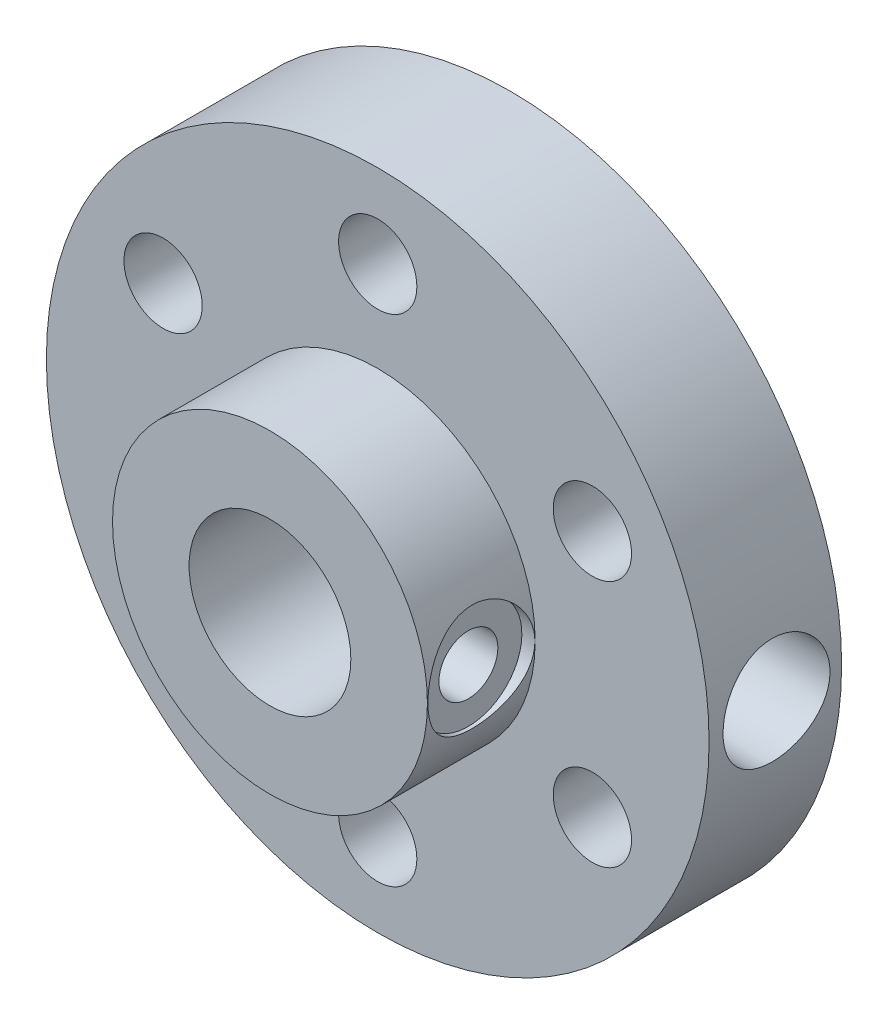
ISO-10303-21;
HEADER;
FILE_DESCRIPTION(('STEP AP214'),'2;1');
FILE_NAME('part.step','',(''),(''),'','','');
FILE_SCHEMA(('AUTOMOTIVE_DESIGN { 1 0 10303 214 1 1 1 1 }'));
ENDSEC;
DATA;
#1=APPLICATION_CONTEXT('core data for automotive mechanical design processes');
#2=APPLICATION_PROTOCOL_DEFINITION('international standard','automotive_design',2000,#1);
#3=PRODUCT_CONTEXT('',#1,'mechanical');
#4=PRODUCT('Part','Part','',(#3));
#5=PRODUCT_RELATED_PRODUCT_CATEGORY('part','',(#4));
#6=PRODUCT_DEFINITION_FORMATION('','',#4);
#7=PRODUCT_DEFINITION_CONTEXT('part definition',#1,'design');
#8=PRODUCT_DEFINITION('design','',#6,#7);
#9=PRODUCT_DEFINITION_SHAPE('','',#8);
#10=(LENGTH_UNIT() NAMED_UNIT(*) SI_UNIT(.MILLI.,.METRE.));
#11=(NAMED_UNIT(*) PLANE_ANGLE_UNIT() SI_UNIT($,.RADIAN.));
#12=(NAMED_UNIT(*) SI_UNIT($,.STERADIAN.) SOLID_ANGLE_UNIT());
#13=UNCERTAINTY_MEASURE_WITH_UNIT(LENGTH_MEASURE(1.E-05),#10,'distance_accuracy_value','');
#14=(GEOMETRIC_REPRESENTATION_CONTEXT(3) GLOBAL_UNCERTAINTY_ASSIGNED_CONTEXT((#13)) GLOBAL_UNIT_ASSIGNED_CONTEXT((#10,
#11,#12)) REPRESENTATION_CONTEXT('',''));
#15=CARTESIAN_POINT('',(0.,0.,0.));
#16=DIRECTION('',(0.,0.,1.));
#17=DIRECTION('',(1.,0.,0.));
#18=AXIS2_PLACEMENT_3D('',#15,#16,#17);
#19=CARTESIAN_POINT('',(0.,0.,5.08));
#20=DIRECTION('',(0.,0.,1.));
#21=DIRECTION('',(1.,0.,0.));
#22=AXIS2_PLACEMENT_3D('',#19,#20,#21);
#23=PLANE('',#22);
#24=CARTESIAN_POINT('',(0.,9.5,5.08));
#25=DIRECTION('',(0.,0.,1.));
#26=DIRECTION('',(1.,0.,0.));
#27=AXIS2_PLACEMENT_3D('',#24,#25,#26);
#28=CIRCLE('',#27,1.5);
#29=CARTESIAN_POINT('',(1.5,9.5,5.08));
#30=VERTEX_POINT('',#29);
#31=EDGE_CURVE('E225',#30,#30,#28,.T.);
#32=ORIENTED_EDGE('',*,*,#31,.F.);
#33=EDGE_LOOP('',(#32));
#34=FACE_BOUND('',#33,.T.);
#35=CARTESIAN_POINT('',(-8.22724133595197,4.74999999999964,5.08));
#36=DIRECTION('',(0.,0.,1.));
#37=DIRECTION('',(1.,0.,0.));
#38=AXIS2_PLACEMENT_3D('',#35,#36,#37);
#39=CIRCLE('',#38,1.50000000000041);
#40=CARTESIAN_POINT('',(-6.72724133595156,4.74999999999964,5.08));
#41=VERTEX_POINT('',#40);
#42=EDGE_CURVE('E259',#41,#41,#39,.T.);
#43=ORIENTED_EDGE('',*,*,#42,.F.);
#44=EDGE_LOOP('',(#43));
#45=FACE_BOUND('',#44,.T.);
#46=CARTESIAN_POINT('',(-8.22724133595156,-4.75000000000035,5.08));
#47=DIRECTION('',(0.,0.,1.));
#48=DIRECTION('',(1.,0.,0.));
#49=AXIS2_PLACEMENT_3D('',#46,#47,#48);
#50=CIRCLE('',#49,1.50000000000077);
#51=CARTESIAN_POINT('',(-6.72724133595079,-4.75000000000035,5.08));
#52=VERTEX_POINT('',#51);
#53=EDGE_CURVE('E262',#52,#52,#50,.T.);
#54=ORIENTED_EDGE('',*,*,#53,.F.);
#55=EDGE_LOOP('',(#54));
#56=FACE_BOUND('',#55,.T.);
#57=CARTESIAN_POINT('',(8.08855304307324E-13,-9.5,5.08));
#58=DIRECTION('',(0.,0.,1.));
#59=DIRECTION('',(1.,0.,0.));
#60=AXIS2_PLACEMENT_3D('',#57,#58,#59);
#61=CIRCLE('',#60,1.50000000000084);
#62=CARTESIAN_POINT('',(1.50000000000165,-9.5,5.08));
#63=VERTEX_POINT('',#62);
#64=EDGE_CURVE('E267',#63,#63,#61,.T.);
#65=ORIENTED_EDGE('',*,*,#64,.F.);
#66=EDGE_LOOP('',(#65));
#67=FACE_BOUND('',#66,.T.);
#68=CARTESIAN_POINT('',(8.22724133595277,-4.74999999999965,5.08));
#69=DIRECTION('',(0.,0.,1.));
#70=DIRECTION('',(1.,0.,0.));
#71=AXIS2_PLACEMENT_3D('',#68,#69,#70);
#72=CIRCLE('',#71,1.50000000000052);
#73=CARTESIAN_POINT('',(9.7272413359533,-4.74999999999965,5.08));
#74=VERTEX_POINT('',#73);
#75=EDGE_CURVE('E256',#74,#74,#72,.T.);
#76=ORIENTED_EDGE('',*,*,#75,.F.);
#77=EDGE_LOOP('',(#76));
#78=FACE_BOUND('',#77,.T.);
#79=CARTESIAN_POINT('',(8.22724133595237,4.75000000000035,5.08));
#80=DIRECTION('',(0.,0.,1.));
#81=DIRECTION('',(1.,0.,0.));
#82=AXIS2_PLACEMENT_3D('',#79,#80,#81);
#83=CIRCLE('',#82,1.50000000000011);
#84=CARTESIAN_POINT('',(9.72724133595248,4.75000000000035,5.08));
#85=VERTEX_POINT('',#84);
#86=EDGE_CURVE('E252',#85,#85,#83,.T.);
#87=ORIENTED_EDGE('',*,*,#86,.F.);
#88=EDGE_LOOP('',(#87));
#89=FACE_BOUND('',#88,.T.);
#90=CARTESIAN_POINT('',(0.,0.,5.08));
#91=DIRECTION('',(0.,0.,1.));
#92=DIRECTION('',(1.,0.,0.));
#93=AXIS2_PLACEMENT_3D('',#90,#91,#92);
#94=CIRCLE('',#93,12.7);
#95=CARTESIAN_POINT('',(12.7,0.,5.08));
#96=VERTEX_POINT('',#95);
#97=EDGE_CURVE('E57',#96,#96,#94,.T.);
#98=ORIENTED_EDGE('',*,*,#97,.T.);
#99=EDGE_LOOP('',(#98));
#100=FACE_BOUND('',#99,.T.);
#101=CARTESIAN_POINT('',(0.,0.,5.08));
#102=DIRECTION('',(0.,0.,1.));
#103=DIRECTION('',(1.,0.,0.));
#104=AXIS2_PLACEMENT_3D('',#101,#102,#103);
#105=CIRCLE('',#104,6.035);
#106=CARTESIAN_POINT('',(6.035,0.,5.08));
#107=VERTEX_POINT('',#106);
#108=EDGE_CURVE('E111',#107,#107,#105,.T.);
#109=ORIENTED_EDGE('',*,*,#108,.F.);
#110=EDGE_LOOP('',(#109));
#111=FACE_BOUND('',#110,.T.);
#112=ADVANCED_FACE('F41',(#34,#45,#56,#67,#78,#89,#100,#111),#23,.T.);
#113=CARTESIAN_POINT('',(0.,0.,5.08));
#114=DIRECTION('',(0.,0.,-1.));
#115=DIRECTION('',(-1.,0.,0.));
#116=AXIS2_PLACEMENT_3D('',#113,#114,#115);
#117=CYLINDRICAL_SURFACE('',#116,12.7);
#118=CARTESIAN_POINT('',(12.5334552299037,2.05,2.49468086127914));
#119=CARTESIAN_POINT('',(12.5334572486081,2.04999536101024,2.38033915071411));
#120=CARTESIAN_POINT('',(12.5350368739811,2.04040125716624,2.26593371494406));
#121=CARTESIAN_POINT('',(12.5411794272438,2.00229289242093,2.04032915086702));
#122=CARTESIAN_POINT('',(12.5457451579925,1.97376085536454,1.92913313752065));
#123=CARTESIAN_POINT('',(12.5573296356305,1.89865904966167,1.71324525419515));
#124=CARTESIAN_POINT('',(12.5643463866815,1.85210395366131,1.60854817365192));
#125=CARTESIAN_POINT('',(12.5800399323086,1.74231347431709,1.40846384542003));
#126=CARTESIAN_POINT('',(12.5887165264896,1.67908010421647,1.31307547597461));
#127=CARTESIAN_POINT('',(12.606841849714,1.53710369338824,1.13342119781227));
#128=CARTESIAN_POINT('',(12.6162963769453,1.45823657318114,1.04925391798866));
#129=CARTESIAN_POINT('',(12.6348606942541,1.28749949790615,0.895287049905271));
#130=CARTESIAN_POINT('',(12.6439704643653,1.19562879120595,0.82548829274655));
#131=CARTESIAN_POINT('',(12.6608799861256,1.00085562917657,0.701871612127254));
#132=CARTESIAN_POINT('',(12.6686721324809,0.897894393969266,0.648145174440912));
#133=CARTESIAN_POINT('',(12.682004015988,0.684261988945243,0.55878595651827));
#134=CARTESIAN_POINT('',(12.6875438906108,0.573591290171308,0.523152071940474));
#135=CARTESIAN_POINT('',(12.6957061132466,0.348699499599961,0.471290288547482));
#136=CARTESIAN_POINT('',(12.6983533364051,0.234517502145317,0.45489684092864));
#137=CARTESIAN_POINT('',(12.7005173827566,0.00499490242623773,0.441466737448935));
#138=CARTESIAN_POINT('',(12.700034406106,-0.110345625286645,0.444428843923279));
#139=CARTESIAN_POINT('',(12.6960122223452,-0.337780082331929,0.46949615852993));
#140=CARTESIAN_POINT('',(12.69250145702,-0.449894220981997,0.491423223246062));
#141=CARTESIAN_POINT('',(12.6828498635968,-0.66883065908114,0.553517801313552));
#142=CARTESIAN_POINT('',(12.676708959338,-0.775652805190278,0.59368584287011));
#143=CARTESIAN_POINT('',(12.6624384978364,-0.981505822215447,0.691300924793478));
#144=CARTESIAN_POINT('',(12.6543004612125,-1.08050102773914,0.748821887083634));
#145=CARTESIAN_POINT('',(12.6369408129038,-1.26750127650061,0.879455906203556));
#146=CARTESIAN_POINT('',(12.6277191188619,-1.35550548338196,0.95257014845402));
#147=CARTESIAN_POINT('',(12.6090947578575,-1.51907736232077,1.11330476514415));
#148=CARTESIAN_POINT('',(12.599691225756,-1.59449206830331,1.20108078754988));
#149=CARTESIAN_POINT('',(12.5818648317841,-1.72954681996361,1.38812146753757));
#150=CARTESIAN_POINT('',(12.5734419779078,-1.78918673705754,1.48738621875722));
#151=CARTESIAN_POINT('',(12.5585303809038,-1.89102594503382,1.69475813307762));
#152=CARTESIAN_POINT('',(12.5520435844542,-1.93320769834733,1.80287405768722));
#153=CARTESIAN_POINT('',(12.5417714691285,-1.99876967722349,2.0247846398186));
#154=CARTESIAN_POINT('',(12.5379859280022,-2.02215144960562,2.13857882932733));
#155=CARTESIAN_POINT('',(12.533587671044,-2.04923617993984,2.367249606801));
#156=CARTESIAN_POINT('',(12.5329398640501,-2.05315679603292,2.48209976182659));
#157=CARTESIAN_POINT('',(12.53479705414,-2.04178713932621,2.71081580207145));
#158=CARTESIAN_POINT('',(12.5373019373054,-2.02649756066317,2.82468172270512));
#159=CARTESIAN_POINT('',(12.545149910149,-1.97732679169388,3.04751123451355));
#160=CARTESIAN_POINT('',(12.5504761977329,-1.94355562435339,3.15649974787415));
#161=CARTESIAN_POINT('',(12.5633528217822,-1.85849540026055,3.36727000596034));
#162=CARTESIAN_POINT('',(12.570903283823,-1.80720535437875,3.46905134337138));
#163=CARTESIAN_POINT('',(12.5874594177473,-1.68804659814653,3.66348903726805));
#164=CARTESIAN_POINT('',(12.5964771439035,-1.62003794502003,3.75605858691697));
#165=CARTESIAN_POINT('',(12.6149161412484,-1.4695653671107,3.92854920490543));
#166=CARTESIAN_POINT('',(12.6243374389656,-1.3871004909589,4.00846944013018));
#167=CARTESIAN_POINT('',(12.6426326048491,-1.20909388777417,4.15418331148522));
#168=CARTESIAN_POINT('',(12.6515002619211,-1.11343284537126,4.21983208698007));
#169=CARTESIAN_POINT('',(12.6675903928394,-0.912313540785326,4.3341266084573));
#170=CARTESIAN_POINT('',(12.6748129173081,-0.806855580203656,4.38277287764801));
#171=CARTESIAN_POINT('',(12.6867719343775,-0.589573473926694,4.46145410041529));
#172=CARTESIAN_POINT('',(12.6915186875311,-0.477777766951419,4.49156596280854));
#173=CARTESIAN_POINT('',(12.6980346116816,-0.25063370238323,4.53257168062696));
#174=CARTESIAN_POINT('',(12.6998040118585,-0.135285618928692,4.54346701523732));
#175=CARTESIAN_POINT('',(12.7001629347967,0.0942885201229108,4.54568993714599));
#176=CARTESIAN_POINT('',(12.6987883403433,0.208512442193081,4.5372383324395));
#177=CARTESIAN_POINT('',(12.693086681774,0.433891528590211,4.5014834800992));
#178=CARTESIAN_POINT('',(12.688759631751,0.545046707562534,4.47418032244931));
#179=CARTESIAN_POINT('',(12.6776373278871,0.761056380508561,4.40158008436421));
#180=CARTESIAN_POINT('',(12.6708444951957,0.865916937866126,4.35630065074331));
#181=CARTESIAN_POINT('',(12.6555336403655,1.06658675951149,4.24905740198147));
#182=CARTESIAN_POINT('',(12.6470155447151,1.16239563786151,4.18709287586905));
#183=CARTESIAN_POINT('',(12.6290839047253,1.34335731318889,4.04745045197614));
#184=CARTESIAN_POINT('',(12.6196616993448,1.42838413994096,3.96961040567926));
#185=CARTESIAN_POINT('',(12.6010450682932,1.58424762466422,3.80076729149683));
#186=CARTESIAN_POINT('',(12.5918506965019,1.65508095358988,3.7097611441378));
#187=CARTESIAN_POINT('',(12.5746654639025,1.78097269683277,3.51645907394262));
#188=CARTESIAN_POINT('',(12.5666829324267,1.8359240921702,3.41409271208295));
#189=CARTESIAN_POINT('',(12.5529233379257,1.92776834767308,3.20149754917328));
#190=CARTESIAN_POINT('',(12.5471440449538,1.96467947752625,3.09127683255953));
#191=CARTESIAN_POINT('',(12.5397445223455,2.0112610132162,2.8996174924851));
#192=CARTESIAN_POINT('',(12.5373989510966,2.0257651819024,2.81934726924156));
#193=CARTESIAN_POINT('',(12.5342535981851,2.04513624952944,2.65762242656455));
#194=CARTESIAN_POINT('',(12.5334537912502,2.05000330603064,2.57616782651679));
#195=CARTESIAN_POINT('',(12.5334552299037,2.05,2.49468086127914));
#196=B_SPLINE_CURVE_WITH_KNOTS('',3,(#118,#119,#120,#121,#122,#123,#124,#125,#126,#127,#128,
#129,#130,#131,#132,#133,#134,#135,#136,#137,#138,#139,#140,#141,#142,#143,#144,#145,#146,#147,
#148,#149,#150,#151,#152,#153,#154,#155,#156,#157,#158,#159,#160,#161,#162,#163,#164,#165,#166,
#167,#168,#169,#170,#171,#172,#173,#174,#175,#176,#177,#178,#179,#180,#181,#182,#183,#184,#185,
#186,#187,#188,#189,#190,#191,#192,#193,#194,#195),.UNSPECIFIED.,.T.,.F.,(4,2,2,2,2,2,2,2,2,2,2,
2,2,2,2,2,2,2,2,2,2,2,2,2,2,2,2,2,2,2,2,2,2,2,2,2,2,2,4),(0.,0.342727194840897,
0.685776547529513,1.02854720764477,1.37127651065459,1.71684348397928,2.06243043990304,
2.40994864619874,2.75744563796913,3.10193024758134,3.44639282980552,3.78765448694477,
4.12892602665112,4.47167238910797,4.81444481686668,5.16111897705515,5.50779596297476,
5.85482036232487,6.20181620637773,6.54492228352797,6.88801596331869,7.22908904165562,
7.57018138042652,7.9142323196865,8.25830590956205,8.60572388060592,8.95313115981523,
9.29908697343599,9.64501615607223,9.98701693637679,10.3290160842241,10.6706803278219,
11.0123591324407,11.35772026422,11.7031623049214,12.0508805220294,12.3982458654641,
12.6424984263722,12.8867469938809),.UNSPECIFIED.);
#197=CARTESIAN_POINT('',(12.5334552299037,2.05,2.49468086127914));
#198=VERTEX_POINT('',#197);
#199=EDGE_CURVE('E10',#198,#198,#196,.T.);
#200=ORIENTED_EDGE('',*,*,#199,.T.);
#201=EDGE_LOOP('',(#200));
#202=FACE_BOUND('',#201,.T.);
#203=ORIENTED_EDGE('',*,*,#97,.F.);
#204=EDGE_LOOP('',(#203));
#205=FACE_BOUND('',#204,.T.);
#206=CARTESIAN_POINT('',(0.,0.,0.));
#207=DIRECTION('',(0.,0.,1.));
#208=DIRECTION('',(1.,0.,0.));
#209=AXIS2_PLACEMENT_3D('',#206,#207,#208);
#210=CIRCLE('',#209,12.7);
#211=CARTESIAN_POINT('',(12.7,0.,0.));
#212=VERTEX_POINT('',#211);
#213=EDGE_CURVE('E116',#212,#212,#210,.T.);
#214=ORIENTED_EDGE('',*,*,#213,.T.);
#215=EDGE_LOOP('',(#214));
#216=FACE_BOUND('',#215,.T.);
#217=ADVANCED_FACE('F43',(#202,#205,#216),#117,.T.);
#218=CARTESIAN_POINT('',(0.,0.,0.));
#219=DIRECTION('',(0.,0.,1.));
#220=DIRECTION('',(1.,0.,0.));
#221=AXIS2_PLACEMENT_3D('',#218,#219,#220);
#222=PLANE('',#221);
#223=CARTESIAN_POINT('',(0.,9.5,0.));
#224=DIRECTION('',(0.,0.,1.));
#225=DIRECTION('',(1.,0.,0.));
#226=AXIS2_PLACEMENT_3D('',#223,#224,#225);
#227=CIRCLE('',#226,1.5);
#228=CARTESIAN_POINT('',(1.5,9.5,0.));
#229=VERTEX_POINT('',#228);
#230=EDGE_CURVE('E46',#229,#229,#227,.T.);
#231=ORIENTED_EDGE('',*,*,#230,.T.);
#232=EDGE_LOOP('',(#231));
#233=FACE_BOUND('',#232,.T.);
#234=CARTESIAN_POINT('',(-8.22724133595197,4.74999999999964,0.));
#235=DIRECTION('',(0.,0.,1.));
#236=DIRECTION('',(1.,0.,0.));
#237=AXIS2_PLACEMENT_3D('',#234,#235,#236);
#238=CIRCLE('',#237,1.50000000000041);
#239=CARTESIAN_POINT('',(-6.72724133595156,4.74999999999964,0.));
#240=VERTEX_POINT('',#239);
#241=EDGE_CURVE('E228',#240,#240,#238,.T.);
#242=ORIENTED_EDGE('',*,*,#241,.T.);
#243=EDGE_LOOP('',(#242));
#244=FACE_BOUND('',#243,.T.);
#245=CARTESIAN_POINT('',(-8.22724133595156,-4.75000000000035,0.));
#246=DIRECTION('',(0.,0.,1.));
#247=DIRECTION('',(1.,0.,0.));
#248=AXIS2_PLACEMENT_3D('',#245,#246,#247);
#249=CIRCLE('',#248,1.50000000000077);
#250=CARTESIAN_POINT('',(-6.72724133595079,-4.75000000000035,0.));
#251=VERTEX_POINT('',#250);
#252=EDGE_CURVE('E233',#251,#251,#249,.T.);
#253=ORIENTED_EDGE('',*,*,#252,.T.);
#254=EDGE_LOOP('',(#253));
#255=FACE_BOUND('',#254,.T.);
#256=CARTESIAN_POINT('',(8.08855304307324E-13,-9.5,0.));
#257=DIRECTION('',(0.,0.,1.));
#258=DIRECTION('',(1.,0.,0.));
#259=AXIS2_PLACEMENT_3D('',#256,#257,#258);
#260=CIRCLE('',#259,1.50000000000084);
#261=CARTESIAN_POINT('',(1.50000000000165,-9.5,0.));
#262=VERTEX_POINT('',#261);
#263=EDGE_CURVE('E237',#262,#262,#260,.T.);
#264=ORIENTED_EDGE('',*,*,#263,.T.);
#265=EDGE_LOOP('',(#264));
#266=FACE_BOUND('',#265,.T.);
#267=CARTESIAN_POINT('',(8.22724133595277,-4.74999999999965,0.));
#268=DIRECTION('',(0.,0.,1.));
#269=DIRECTION('',(1.,0.,0.));
#270=AXIS2_PLACEMENT_3D('',#267,#268,#269);
#271=CIRCLE('',#270,1.50000000000052);
#272=CARTESIAN_POINT('',(9.7272413359533,-4.74999999999965,0.));
#273=VERTEX_POINT('',#272);
#274=EDGE_CURVE('E242',#273,#273,#271,.T.);
#275=ORIENTED_EDGE('',*,*,#274,.T.);
#276=EDGE_LOOP('',(#275));
#277=FACE_BOUND('',#276,.T.);
#278=CARTESIAN_POINT('',(8.22724133595237,4.75000000000035,0.));
#279=DIRECTION('',(0.,0.,1.));
#280=DIRECTION('',(1.,0.,0.));
#281=AXIS2_PLACEMENT_3D('',#278,#279,#280);
#282=CIRCLE('',#281,1.50000000000011);
#283=CARTESIAN_POINT('',(9.72724133595248,4.75000000000035,0.));
#284=VERTEX_POINT('',#283);
#285=EDGE_CURVE('E70',#284,#284,#282,.T.);
#286=ORIENTED_EDGE('',*,*,#285,.T.);
#287=EDGE_LOOP('',(#286));
#288=FACE_BOUND('',#287,.T.);
#289=CARTESIAN_POINT('',(0.,0.,0.));
#290=DIRECTION('',(0.,0.,1.));
#291=DIRECTION('',(1.,0.,0.));
#292=AXIS2_PLACEMENT_3D('',#289,#290,#291);
#293=CIRCLE('',#292,3.1);
#294=CARTESIAN_POINT('',(3.1,0.,0.));
#295=VERTEX_POINT('',#294);
#296=EDGE_CURVE('E107',#295,#295,#293,.F.);
#297=ORIENTED_EDGE('',*,*,#296,.F.);
#298=EDGE_LOOP('',(#297));
#299=FACE_BOUND('',#298,.T.);
#300=ORIENTED_EDGE('',*,*,#213,.F.);
#301=EDGE_LOOP('',(#300));
#302=FACE_BOUND('',#301,.T.);
#303=ADVANCED_FACE('F127',(#233,#244,#255,#266,#277,#288,#299,#302),#222,.F.);
#304=CARTESIAN_POINT('',(0.,0.,9.21));
#305=DIRECTION('',(0.,0.,-1.));
#306=DIRECTION('',(-1.,0.,0.));
#307=AXIS2_PLACEMENT_3D('',#304,#305,#306);
#308=CYLINDRICAL_SURFACE('',#307,6.035);
#309=CARTESIAN_POINT('',(5.67615406767646,2.05,7.14097271657416));
#310=CARTESIAN_POINT('',(5.67615329732965,2.05000098302527,7.02944982676044));
#311=CARTESIAN_POINT('',(5.6794767026821,2.04086878834927,6.91793359372519));
#312=CARTESIAN_POINT('',(5.69233877855883,2.00471060878538,6.69821356488151));
#313=CARTESIAN_POINT('',(5.70187827696146,1.97768224042246,6.59001021230266));
#314=CARTESIAN_POINT('',(5.72597001601498,1.90679757728606,6.38013623788336));
#315=CARTESIAN_POINT('',(5.74051211830512,1.86297529701358,6.27845289318462));
#316=CARTESIAN_POINT('',(5.77295556391696,1.75986363514059,6.08384724069902));
#317=CARTESIAN_POINT('',(5.7908576918675,1.70057063957426,5.99092698688809));
#318=CARTESIAN_POINT('',(5.82882009867105,1.56561882985739,5.81270799441414));
#319=CARTESIAN_POINT('',(5.84893564847816,1.48943669472425,5.72781719947592));
#320=CARTESIAN_POINT('',(5.88859212235395,1.32398503441914,5.57173688194607));
#321=CARTESIAN_POINT('',(5.90813294962692,1.23471331966166,5.50054965626312));
#322=CARTESIAN_POINT('',(5.94508065640441,1.0426169728112,5.37202985055787));
#323=CARTESIAN_POINT('',(5.962414991596,0.939489628901688,5.31512702718522));
#324=CARTESIAN_POINT('',(5.99234348155934,0.724436410317064,5.21963944815242));
#325=CARTESIAN_POINT('',(6.00493896603385,0.612513014451183,5.18104955316164));
#326=CARTESIAN_POINT('',(6.02357897393679,0.387323724661142,5.12467347240352));
#327=CARTESIAN_POINT('',(6.02984314025605,0.274251433392958,5.10618794391421));
#328=CARTESIAN_POINT('',(6.03589562251155,0.0464479832614385,5.08831918531564));
#329=CARTESIAN_POINT('',(6.03568567037669,-0.0682827237406328,5.08893084640719));
#330=CARTESIAN_POINT('',(6.02896109552273,-0.291187151007666,5.10880078122801));
#331=CARTESIAN_POINT('',(6.02270348320838,-0.399437662835165,5.12729893968682));
#332=CARTESIAN_POINT('',(6.00491147565195,-0.611195012056191,5.18115664234734));
#333=CARTESIAN_POINT('',(5.99337671943068,-0.714701524406918,5.2165173400258));
#334=CARTESIAN_POINT('',(5.96600469165288,-0.915666025728827,5.30352646366927));
#335=CARTESIAN_POINT('',(5.95011185331009,-1.01302441362591,5.35538673536954));
#336=CARTESIAN_POINT('',(5.91567136087184,-1.19787782811748,5.47374661459075));
#337=CARTESIAN_POINT('',(5.89712294950857,-1.28537002848719,5.54025040080176));
#338=CARTESIAN_POINT('',(5.85825257802921,-1.45252396285309,5.68981613689392));
#339=CARTESIAN_POINT('',(5.83788823975745,-1.53159562069781,5.77352749936972));
#340=CARTESIAN_POINT('',(5.798438252496,-1.67477394166908,5.9531891318542));
#341=CARTESIAN_POINT('',(5.77935281705163,-1.73887811001055,6.04914143807084));
#342=CARTESIAN_POINT('',(5.74438423733127,-1.85116165777935,6.25249660014436));
#343=CARTESIAN_POINT('',(5.7285545801581,-1.89908226681902,6.36005224266023));
#344=CARTESIAN_POINT('',(5.70250811439952,-1.97592814030375,6.58238045950079));
#345=CARTESIAN_POINT('',(5.6922888447821,-2.00486173461262,6.69714984480909));
#346=CARTESIAN_POINT('',(5.6791804908733,-2.04169059705267,6.92491348231771));
#347=CARTESIAN_POINT('',(5.67597173912172,-2.05050420406226,7.03774084558463));
#348=CARTESIAN_POINT('',(5.67635242942246,-2.04945140195118,7.26328417791204));
#349=CARTESIAN_POINT('',(5.6799405749866,-2.03958855530927,7.37600016411416));
#350=CARTESIAN_POINT('',(5.69319116526613,-2.00228923171862,7.59386957979904));
#351=CARTESIAN_POINT('',(5.7026293376868,-1.97550092273185,7.69914909616943));
#352=CARTESIAN_POINT('',(5.72626698620871,-1.90589429405493,7.90369420323873));
#353=CARTESIAN_POINT('',(5.74046732658698,-1.86307306441535,8.00295869841879));
#354=CARTESIAN_POINT('',(5.77260256261031,-1.76103012793416,8.19624740673119));
#355=CARTESIAN_POINT('',(5.79064420016713,-1.70131885284839,8.28999492954049));
#356=CARTESIAN_POINT('',(5.82822626639219,-1.56774050372242,8.46647084652021));
#357=CARTESIAN_POINT('',(5.84776715203128,-1.49386910331319,8.54919585983503));
#358=CARTESIAN_POINT('',(5.88733407420208,-1.32965971841098,8.70557910363005));
#359=CARTESIAN_POINT('',(5.90733511693807,-1.23868063049925,8.77857248200737));
#360=CARTESIAN_POINT('',(5.94460395423278,-1.04527213934157,8.90830463113573));
#361=CARTESIAN_POINT('',(5.96187183432466,-0.942843094588418,8.96504391059696));
#362=CARTESIAN_POINT('',(5.99165583706325,-0.729902204282967,9.06015195185921));
#363=CARTESIAN_POINT('',(6.00420126531374,-0.619445459285833,9.09863440969226));
#364=CARTESIAN_POINT('',(6.02325149476547,-0.393115711002001,9.15630987638758));
#365=CARTESIAN_POINT('',(6.0297585699389,-0.277244763920239,9.17551014691711));
#366=CARTESIAN_POINT('',(6.03582076615483,-0.0494456473287122,9.19340303149523));
#367=CARTESIAN_POINT('',(6.0356988830418,0.0623998783255783,9.19304844325447));
#368=CARTESIAN_POINT('',(6.02931894082078,0.284363600959493,9.17420665867746));
#369=CARTESIAN_POINT('',(6.02306141217707,0.394481946428275,9.15572102988109));
#370=CARTESIAN_POINT('',(6.00523638255454,0.607992521984599,9.1017807539556));
#371=CARTESIAN_POINT('',(5.99376110128781,0.711467348300914,9.06662037417479));
#372=CARTESIAN_POINT('',(5.96668301296469,0.911085145583175,8.9806037215459));
#373=CARTESIAN_POINT('',(5.95107945036118,1.00722677029227,8.9297445752668));
#374=CARTESIAN_POINT('',(5.91661134944207,1.1934158468392,8.81156335300297));
#375=CARTESIAN_POINT('',(5.89764580101165,1.2830953096062,8.74369140396709));
#376=CARTESIAN_POINT('',(5.85882210646529,1.45010105170177,8.59433610513015));
#377=CARTESIAN_POINT('',(5.838963671604,1.5274232975469,8.51284832870727));
#378=CARTESIAN_POINT('',(5.79961700252869,1.67075581044161,8.33457390760033));
#379=CARTESIAN_POINT('',(5.78017751154664,1.73617069236164,8.23729620277053));
#380=CARTESIAN_POINT('',(5.74486160414566,1.84968671984251,8.03251910101977));
#381=CARTESIAN_POINT('',(5.72898442901132,1.89779155348282,7.92502188764529));
#382=CARTESIAN_POINT('',(5.70324430216268,1.97377753337524,7.70635586569714));
#383=CARTESIAN_POINT('',(5.69320302905525,2.00226386702023,7.59541913581745));
#384=CARTESIAN_POINT('',(5.67965955542806,2.04037099465054,7.36997591740819));
#385=CARTESIAN_POINT('',(5.67615485857454,2.04999899074963,7.25547080864386));
#386=CARTESIAN_POINT('',(5.67615406767646,2.05,7.14097271657416));
#387=B_SPLINE_CURVE_WITH_KNOTS('',3,(#309,#310,#311,#312,#313,#314,#315,#316,#317,#318,#319,
#320,#321,#322,#323,#324,#325,#326,#327,#328,#329,#330,#331,#332,#333,#334,#335,#336,#337,#338,
#339,#340,#341,#342,#343,#344,#345,#346,#347,#348,#349,#350,#351,#352,#353,#354,#355,#356,#357,
#358,#359,#360,#361,#362,#363,#364,#365,#366,#367,#368,#369,#370,#371,#372,#373,#374,#375,#376,
#377,#378,#379,#380,#381,#382,#383,#384,#385,#386),.UNSPECIFIED.,.T.,.F.,(4,2,2,2,2,2,2,2,2,2,2,
2,2,2,2,2,2,2,2,2,2,2,2,2,2,2,2,2,2,2,2,2,2,2,2,2,2,2,4),(0.,0.334144317512374,
0.668333146488088,1.00184865426973,1.33544214127953,1.68134957448726,2.02731493620157,
2.38269530044044,2.73797587185311,3.08045803061925,3.42284857079571,3.75130042941245,
4.0797747588998,4.41264934985952,4.74561905368225,5.09482937830342,5.44409786790703,
5.7987124104254,6.1531712744868,6.4910972050888,6.82895868380357,7.15460661350002,
7.48031367644777,7.81664887588975,8.15308700070757,8.5064381175983,8.85977817432776,
9.21088791071762,9.56186536962125,9.89575753415898,10.2296208342114,10.5577998888567,
10.8860390475628,11.2266919914438,11.5674559007642,11.9222222998763,12.2769130676303,
12.6201027628762,12.9631613663163),.UNSPECIFIED.);
#388=CARTESIAN_POINT('',(5.67615406767646,2.05,7.14097271657416));
#389=VERTEX_POINT('',#388);
#390=EDGE_CURVE('E51',#389,#389,#387,.T.);
#391=ORIENTED_EDGE('',*,*,#390,.T.);
#392=EDGE_LOOP('',(#391));
#393=FACE_BOUND('',#392,.T.);
#394=CARTESIAN_POINT('',(0.,0.,9.21));
#395=DIRECTION('',(0.,0.,1.));
#396=DIRECTION('',(1.,0.,0.));
#397=AXIS2_PLACEMENT_3D('',#394,#395,#396);
#398=CIRCLE('',#397,6.035);
#399=CARTESIAN_POINT('',(6.035,0.,9.21));
#400=VERTEX_POINT('',#399);
#401=EDGE_CURVE('E112',#400,#400,#398,.T.);
#402=ORIENTED_EDGE('',*,*,#401,.F.);
#403=EDGE_LOOP('',(#402));
#404=FACE_BOUND('',#403,.T.);
#405=ORIENTED_EDGE('',*,*,#108,.T.);
#406=EDGE_LOOP('',(#405));
#407=FACE_BOUND('',#406,.T.);
#408=ADVANCED_FACE('F129',(#393,#404,#407),#308,.T.);
#409=CARTESIAN_POINT('',(0.,0.,9.21));
#410=DIRECTION('',(0.,0.,1.));
#411=DIRECTION('',(1.,0.,0.));
#412=AXIS2_PLACEMENT_3D('',#409,#410,#411);
#413=PLANE('',#412);
#414=CARTESIAN_POINT('',(0.,0.,9.21));
#415=DIRECTION('',(0.,0.,1.));
#416=DIRECTION('',(1.,0.,0.));
#417=AXIS2_PLACEMENT_3D('',#414,#415,#416);
#418=CIRCLE('',#417,3.1);
#419=CARTESIAN_POINT('',(3.1,0.,9.21));
#420=VERTEX_POINT('',#419);
#421=EDGE_CURVE('E103',#420,#420,#418,.T.);
#422=ORIENTED_EDGE('',*,*,#421,.F.);
#423=EDGE_LOOP('',(#422));
#424=FACE_BOUND('',#423,.T.);
#425=ORIENTED_EDGE('',*,*,#401,.T.);
#426=EDGE_LOOP('',(#425));
#427=FACE_BOUND('',#426,.T.);
#428=ADVANCED_FACE('F135',(#424,#427),#413,.T.);
#429=CARTESIAN_POINT('',(0.,0.,-0.000999999999999265));
#430=DIRECTION('',(0.,0.,1.));
#431=DIRECTION('',(1.,0.,0.));
#432=AXIS2_PLACEMENT_3D('',#429,#430,#431);
#433=CYLINDRICAL_SURFACE('',#432,3.1);
#434=CARTESIAN_POINT('',(3.1,0.,1.36438086127915));
#435=CARTESIAN_POINT('',(3.10000120074954,0.0613321430336925,1.36437922276112));
#436=CARTESIAN_POINT('',(3.09816376339156,0.122652776637039,1.36938864330652));
#437=CARTESIAN_POINT('',(3.09101675890993,0.243468054019813,1.38921807309489));
#438=CARTESIAN_POINT('',(3.0857074787233,0.302962848273808,1.40403727159146));
#439=CARTESIAN_POINT('',(3.07218852745522,0.418367015607754,1.44289695103708));
#440=CARTESIAN_POINT('',(3.06398426390645,0.474282845334627,1.46692024680225));
#441=CARTESIAN_POINT('',(3.04549765773156,0.581288398877817,1.52342128838093));
#442=CARTESIAN_POINT('',(3.03521479171023,0.632376902402152,1.5559011641684));
#443=CARTESIAN_POINT('',(3.0131726286101,0.730345739651794,1.62976873211688));
#444=CARTESIAN_POINT('',(3.00137314593432,0.777004464882072,1.67143824513714));
#445=CARTESIAN_POINT('',(2.97783120935817,0.862847747965236,1.76190385001697));
#446=CARTESIAN_POINT('',(2.96608877246512,0.902030195940648,1.81070194679185));
#447=CARTESIAN_POINT('',(2.94352962789113,0.973179741588535,1.91616032399437));
#448=CARTESIAN_POINT('',(2.93276075664556,1.00484032258375,1.97303864986903));
#449=CARTESIAN_POINT('',(2.91398963087958,1.05804840602176,2.09176779778421));
#450=CARTESIAN_POINT('',(2.90598634020346,1.07959969710734,2.15361674679689));
#451=CARTESIAN_POINT('',(2.8940804708056,1.11111370297965,2.27798715138402));
#452=CARTESIAN_POINT('',(2.890029456036,1.12149753438077,2.34038722688494));
#453=CARTESIAN_POINT('',(2.88605111525467,1.1316986913503,2.46616549449033));
#454=CARTESIAN_POINT('',(2.88612220348591,1.13152008024882,2.52954330108511));
#455=CARTESIAN_POINT('',(2.89025150299892,1.12092469245633,2.65169608765739));
#456=CARTESIAN_POINT('',(2.89408588250864,1.11108266037078,2.71052986659312));
#457=CARTESIAN_POINT('',(2.90493922315069,1.08238669946617,2.82564492075857));
#458=CARTESIAN_POINT('',(2.91195863744315,1.06353148825029,2.88192583151772));
#459=CARTESIAN_POINT('',(2.92853213487955,1.01701353752791,2.99154333054644));
#460=CARTESIAN_POINT('',(2.93813013618724,0.989196346434862,3.04480744346564));
#461=CARTESIAN_POINT('',(2.95876375142142,0.925651552714977,3.14608242473241));
#462=CARTESIAN_POINT('',(2.96979984155684,0.889921327010779,3.19409154320761));
#463=CARTESIAN_POINT('',(2.99291829094849,0.808901411311478,3.28668821432142));
#464=CARTESIAN_POINT('',(3.00502267301574,0.763149980941691,3.33086720416274));
#465=CARTESIAN_POINT('',(3.02831098274679,0.664745322451757,3.41104333729502));
#466=CARTESIAN_POINT('',(3.03949478385098,0.61209114792744,3.44703935680213));
#467=CARTESIAN_POINT('',(3.05988302724086,0.500379436903604,3.51024570809041));
#468=CARTESIAN_POINT('',(3.06905778509989,0.441243044304873,3.53732691908267));
#469=CARTESIAN_POINT('',(3.08417541156957,0.318836711408973,3.58102309102623));
#470=CARTESIAN_POINT('',(3.09011963382643,0.255568514871459,3.59764243612988));
#471=CARTESIAN_POINT('',(3.09787202104598,0.13013836430585,3.61917375621225));
#472=CARTESIAN_POINT('',(3.09987453241213,0.0680828456854345,3.62463637037956));
#473=CARTESIAN_POINT('',(3.10011385482826,-0.0560828788841574,3.62529350234877));
#474=CARTESIAN_POINT('',(3.09835144719382,-0.118193070813429,3.62049015059726));
#475=CARTESIAN_POINT('',(3.09138734335181,-0.238371332868485,3.60117508025267));
#476=CARTESIAN_POINT('',(3.08631141434872,-0.296504463961768,3.58701815406786));
#477=CARTESIAN_POINT('',(3.07335654014166,-0.409534268341914,3.54985879984108));
#478=CARTESIAN_POINT('',(3.06547723032293,-0.464430519548856,3.52685522114975));
#479=CARTESIAN_POINT('',(3.0474178519217,-0.571193059468396,3.47193405617355));
#480=CARTESIAN_POINT('',(3.03717818837062,-0.622926992468526,3.43977936672063));
#481=CARTESIAN_POINT('',(3.01553872289802,-0.72043371674487,3.3677392156204));
#482=CARTESIAN_POINT('',(3.0041385106467,-0.766204386486752,3.32785101513151));
#483=CARTESIAN_POINT('',(2.98066258746683,-0.853104654153345,3.23890142250109));
#484=CARTESIAN_POINT('',(2.96858408250104,-0.893842672218977,3.18945722578869));
#485=CARTESIAN_POINT('',(2.94572704776196,-0.966513168766981,3.08418970841957));
#486=CARTESIAN_POINT('',(2.93494860221976,-0.998445076872015,3.02836597488724));
#487=CARTESIAN_POINT('',(2.91597640256911,-1.0525733564952,2.91159332662789));
#488=CARTESIAN_POINT('',(2.90778857547031,-1.07474744797188,2.85063305758787));
#489=CARTESIAN_POINT('',(2.89513718999684,-1.10838162587641,2.72546524374459));
#490=CARTESIAN_POINT('',(2.89067149744614,-1.11984785237288,2.6612595821977));
#491=CARTESIAN_POINT('',(2.88624329087325,-1.13120875356745,2.53564015625745));
#492=CARTESIAN_POINT('',(2.8860227683771,-1.13176645086613,2.47429490809219));
#493=CARTESIAN_POINT('',(2.8894544318839,-1.12297590899282,2.35243455813735));
#494=CARTESIAN_POINT('',(2.89310629055259,-1.11362850710378,2.29191938661895));
#495=CARTESIAN_POINT('',(2.90366201418016,-1.08579815741329,2.17510402938316));
#496=CARTESIAN_POINT('',(2.91047451790768,-1.06757118461488,2.11873391301623));
#497=CARTESIAN_POINT('',(2.92653544953912,-1.02271937897829,2.00981556474861));
#498=CARTESIAN_POINT('',(2.93578447635993,-0.99609248105291,1.95726827658812));
#499=CARTESIAN_POINT('',(2.95625536884101,-0.933640334129915,1.85461634707987));
#500=CARTESIAN_POINT('',(2.96755305903415,-0.897419828998403,1.8047674580307));
#501=CARTESIAN_POINT('',(2.99057364903489,-0.817434721524966,1.71164272701633));
#502=CARTESIAN_POINT('',(3.00229667927227,-0.773667789380301,1.66836892275685));
#503=CARTESIAN_POINT('',(3.02555134788035,-0.677212477567054,1.5874219111637));
#504=CARTESIAN_POINT('',(3.03704408758119,-0.624187371217567,1.55013707470768));
#505=CARTESIAN_POINT('',(3.05791842004701,-0.512224539475453,1.48502907695746));
#506=CARTESIAN_POINT('',(3.06730004134205,-0.453286894001586,1.45720578779549));
#507=CARTESIAN_POINT('',(3.08303872680783,-0.329869765915184,1.4115476171113));
#508=CARTESIAN_POINT('',(3.08933053682645,-0.265302081267983,1.39392693191236));
#509=CARTESIAN_POINT('',(3.09780962849293,-0.133817678431578,1.37034697635863));
#510=CARTESIAN_POINT('',(3.09999869020498,-0.0669019918165643,1.3643826485984));
#511=CARTESIAN_POINT('',(3.1,0.,1.36438086127915));
#512=B_SPLINE_CURVE_WITH_KNOTS('',3,(#434,#435,#436,#437,#438,#439,#440,#441,#442,#443,#444,
#445,#446,#447,#448,#449,#450,#451,#452,#453,#454,#455,#456,#457,#458,#459,#460,#461,#462,#463,
#464,#465,#466,#467,#468,#469,#470,#471,#472,#473,#474,#475,#476,#477,#478,#479,#480,#481,#482,
#483,#484,#485,#486,#487,#488,#489,#490,#491,#492,#493,#494,#495,#496,#497,#498,#499,#500,#501,
#502,#503,#504,#505,#506,#507,#508,#509,#510,#511),.UNSPECIFIED.,.T.,.F.,(4,2,2,2,2,2,2,2,2,2,2,
2,2,2,2,2,2,2,2,2,2,2,2,2,2,2,2,2,2,2,2,2,2,2,2,2,2,2,4),(0.,0.183749801446956,
0.367484418463102,0.550877639075801,0.734317096027845,0.924450883028623,1.11463824851076,
1.31159613097639,1.5084801407548,1.69764707304057,1.88674123402476,2.06523050499193,
2.24374517900849,2.42551761740391,2.60735040164279,2.80068574258528,2.9940476186426,
3.19009811267114,3.38606639493882,3.57210308612207,3.75810117375331,3.93742060847946,
4.11676337447285,4.30125844980018,4.48581898425165,4.68048957473779,4.87517277120198,
5.07029821046058,5.26531169270713,5.44843273086426,5.63153829094401,5.80965250933419,
5.9878105505453,6.17492850728451,6.36210433658671,6.55864190809432,6.7551768233957,
6.9557007955486,7.15613774597354),.UNSPECIFIED.);
#513=CARTESIAN_POINT('',(3.1,0.,1.36438086127915));
#514=VERTEX_POINT('',#513);
#515=EDGE_CURVE('E179',#514,#514,#512,.T.);
#516=ORIENTED_EDGE('',*,*,#515,.T.);
#517=EDGE_LOOP('',(#516));
#518=FACE_BOUND('',#517,.T.);
#519=CARTESIAN_POINT('',(3.1,0.,6.01067271657417));
#520=CARTESIAN_POINT('',(3.10000120074954,0.0613321430336925,6.01067107805614));
#521=CARTESIAN_POINT('',(3.09816376339156,0.122652776637039,6.01568049860154));
#522=CARTESIAN_POINT('',(3.09101675890993,0.243468054019813,6.03550992838991));
#523=CARTESIAN_POINT('',(3.0857074787233,0.302962848273807,6.05032912688648));
#524=CARTESIAN_POINT('',(3.07218852745522,0.418367015607754,6.0891888063321));
#525=CARTESIAN_POINT('',(3.06398426390645,0.474282845334627,6.11321210209727));
#526=CARTESIAN_POINT('',(3.04549765773156,0.581288398877817,6.16971314367595));
#527=CARTESIAN_POINT('',(3.03521479171023,0.632376902402152,6.20219301946342));
#528=CARTESIAN_POINT('',(3.0131726286101,0.730345739651794,6.2760605874119));
#529=CARTESIAN_POINT('',(3.00137314593432,0.777004464882072,6.31773010043216));
#530=CARTESIAN_POINT('',(2.97783120935817,0.862847747965236,6.40819570531198));
#531=CARTESIAN_POINT('',(2.96608877246512,0.902030195940648,6.45699380208686));
#532=CARTESIAN_POINT('',(2.94352962789113,0.973179741588535,6.56245217928939));
#533=CARTESIAN_POINT('',(2.93276075664556,1.00484032258375,6.61933050516405));
#534=CARTESIAN_POINT('',(2.91398963087958,1.05804840602176,6.73805965307923));
#535=CARTESIAN_POINT('',(2.90598634020347,1.07959969710734,6.79990860209191));
#536=CARTESIAN_POINT('',(2.8940804708056,1.11111370297965,6.92427900667904));
#537=CARTESIAN_POINT('',(2.890029456036,1.12149753438076,6.98667908217996));
#538=CARTESIAN_POINT('',(2.88605111525467,1.13169869135029,7.11245734978535));
#539=CARTESIAN_POINT('',(2.88612220348591,1.13152008024882,7.17583515638013));
#540=CARTESIAN_POINT('',(2.89025150299892,1.12092469245633,7.29798794295241));
#541=CARTESIAN_POINT('',(2.89408588250864,1.11108266037078,7.35682172188814));
#542=CARTESIAN_POINT('',(2.90493922315069,1.08238669946617,7.47193677605359));
#543=CARTESIAN_POINT('',(2.91195863744315,1.06353148825029,7.52821768681274));
#544=CARTESIAN_POINT('',(2.92853213487955,1.01701353752791,7.63783518584146));
#545=CARTESIAN_POINT('',(2.93813013618724,0.989196346434861,7.69109929876067));
#546=CARTESIAN_POINT('',(2.95876375142142,0.925651552714976,7.79237428002743));
#547=CARTESIAN_POINT('',(2.96979984155685,0.889921327010778,7.84038339850263));
#548=CARTESIAN_POINT('',(2.99291829094849,0.808901411311478,7.93298006961643));
#549=CARTESIAN_POINT('',(3.00502267301574,0.763149980941691,7.97715905945776));
#550=CARTESIAN_POINT('',(3.02831098274679,0.664745322451757,8.05733519259004));
#551=CARTESIAN_POINT('',(3.03949478385098,0.612091147927439,8.09333121209715));
#552=CARTESIAN_POINT('',(3.05988302724086,0.500379436903602,8.15653756338543));
#553=CARTESIAN_POINT('',(3.06905778509989,0.441243044304871,8.18361877437769));
#554=CARTESIAN_POINT('',(3.08417541156957,0.318836711408971,8.22731494632126));
#555=CARTESIAN_POINT('',(3.09011963382643,0.255568514871457,8.2439342914249));
#556=CARTESIAN_POINT('',(3.09787202104598,0.130138364305849,8.26546561150727));
#557=CARTESIAN_POINT('',(3.09987453241213,0.0680828456854328,8.27092822567458));
#558=CARTESIAN_POINT('',(3.10011385482826,-0.0560828788841588,8.27158535764378));
#559=CARTESIAN_POINT('',(3.09835144719382,-0.11819307081343,8.26678200589227));
#560=CARTESIAN_POINT('',(3.09138734335181,-0.238371332868486,8.24746693554769));
#561=CARTESIAN_POINT('',(3.08631141434872,-0.296504463961768,8.23331000936288));
#562=CARTESIAN_POINT('',(3.07335654014166,-0.409534268341914,8.1961506551361));
#563=CARTESIAN_POINT('',(3.06547723032293,-0.464430519548857,8.17314707644477));
#564=CARTESIAN_POINT('',(3.0474178519217,-0.571193059468397,8.11822591146857));
#565=CARTESIAN_POINT('',(3.03717818837062,-0.622926992468527,8.08607122201564));
#566=CARTESIAN_POINT('',(3.01553872289802,-0.720433716744871,8.01403107091542));
#567=CARTESIAN_POINT('',(3.0041385106467,-0.766204386486753,7.97414287042653));
#568=CARTESIAN_POINT('',(2.98066258746683,-0.853104654153345,7.88519327779611));
#569=CARTESIAN_POINT('',(2.96858408250104,-0.893842672218977,7.83574908108371));
#570=CARTESIAN_POINT('',(2.94572704776196,-0.966513168766982,7.73048156371458));
#571=CARTESIAN_POINT('',(2.93494860221976,-0.998445076872015,7.67465783018226));
#572=CARTESIAN_POINT('',(2.91597640256911,-1.0525733564952,7.55788518192291));
#573=CARTESIAN_POINT('',(2.90778857547031,-1.07474744797188,7.49692491288289));
#574=CARTESIAN_POINT('',(2.89513718999684,-1.10838162587641,7.37175709903961));
#575=CARTESIAN_POINT('',(2.89067149744614,-1.11984785237288,7.30755143749272));
#576=CARTESIAN_POINT('',(2.88624329087325,-1.13120875356745,7.18193201155247));
#577=CARTESIAN_POINT('',(2.8860227683771,-1.13176645086613,7.12058676338721));
#578=CARTESIAN_POINT('',(2.8894544318839,-1.12297590899282,6.99872641343237));
#579=CARTESIAN_POINT('',(2.89310629055259,-1.11362850710378,6.93821124191397));
#580=CARTESIAN_POINT('',(2.90366201418016,-1.08579815741329,6.82139588467818));
#581=CARTESIAN_POINT('',(2.91047451790768,-1.06757118461488,6.76502576831124));
#582=CARTESIAN_POINT('',(2.92653544953912,-1.02271937897829,6.65610742004363));
#583=CARTESIAN_POINT('',(2.93578447635993,-0.99609248105291,6.60356013188314));
#584=CARTESIAN_POINT('',(2.95625536884101,-0.933640334129915,6.50090820237489));
#585=CARTESIAN_POINT('',(2.96755305903415,-0.897419828998404,6.45105931332571));
#586=CARTESIAN_POINT('',(2.99057364903489,-0.817434721524967,6.35793458231135));
#587=CARTESIAN_POINT('',(3.00229667927227,-0.773667789380301,6.31466077805187));
#588=CARTESIAN_POINT('',(3.02555134788035,-0.677212477567054,6.23371376645871));
#589=CARTESIAN_POINT('',(3.03704408758119,-0.624187371217568,6.1964289300027));
#590=CARTESIAN_POINT('',(3.05791842004701,-0.512224539475454,6.13132093225248));
#591=CARTESIAN_POINT('',(3.06730004134205,-0.453286894001586,6.10349764309051));
#592=CARTESIAN_POINT('',(3.08303872680783,-0.329869765915184,6.05783947240631));
#593=CARTESIAN_POINT('',(3.08933053682645,-0.265302081267983,6.04021878720738));
#594=CARTESIAN_POINT('',(3.09780962849293,-0.133817678431578,6.01663883165364));
#595=CARTESIAN_POINT('',(3.09999869020498,-0.0669019918165643,6.01067450389342));
#596=CARTESIAN_POINT('',(3.1,0.,6.01067271657417));
#597=B_SPLINE_CURVE_WITH_KNOTS('',3,(#519,#520,#521,#522,#523,#524,#525,#526,#527,#528,#529,
#530,#531,#532,#533,#534,#535,#536,#537,#538,#539,#540,#541,#542,#543,#544,#545,#546,#547,#548,
#549,#550,#551,#552,#553,#554,#555,#556,#557,#558,#559,#560,#561,#562,#563,#564,#565,#566,#567,
#568,#569,#570,#571,#572,#573,#574,#575,#576,#577,#578,#579,#580,#581,#582,#583,#584,#585,#586,
#587,#588,#589,#590,#591,#592,#593,#594,#595,#596),.UNSPECIFIED.,.T.,.F.,(4,2,2,2,2,2,2,2,2,2,2,
2,2,2,2,2,2,2,2,2,2,2,2,2,2,2,2,2,2,2,2,2,2,2,2,2,2,2,4),(0.,0.183749801446956,
0.367484418463102,0.550877639075801,0.734317096027845,0.924450883028623,1.11463824851076,
1.31159613097639,1.5084801407548,1.69764707304057,1.88674123402476,2.06523050499193,
2.24374517900849,2.42551761740391,2.60735040164279,2.80068574258528,2.9940476186426,
3.19009811267114,3.38606639493882,3.57210308612207,3.75810117375331,3.93742060847946,
4.11676337447285,4.30125844980018,4.48581898425165,4.68048957473779,4.87517277120198,
5.07029821046058,5.26531169270713,5.44843273086426,5.631538290944,5.80965250933419,
5.9878105505453,6.17492850728451,6.36210433658671,6.55864190809431,6.7551768233957,
6.9557007955486,7.15613774597354),.UNSPECIFIED.);
#598=CARTESIAN_POINT('',(3.1,0.,6.01067271657417));
#599=VERTEX_POINT('',#598);
#600=EDGE_CURVE('E89',#599,#599,#597,.T.);
#601=ORIENTED_EDGE('',*,*,#600,.T.);
#602=EDGE_LOOP('',(#601));
#603=FACE_BOUND('',#602,.T.);
#604=ORIENTED_EDGE('',*,*,#421,.T.);
#605=EDGE_LOOP('',(#604));
#606=FACE_BOUND('',#605,.T.);
#607=ORIENTED_EDGE('',*,*,#296,.T.);
#608=EDGE_LOOP('',(#607));
#609=FACE_BOUND('',#608,.T.);
#610=ADVANCED_FACE('F150',(#518,#603,#606,#609),#433,.F.);
#611=CARTESIAN_POINT('',(5.535,0.,7.14097271657416));
#612=DIRECTION('',(1.,0.,0.));
#613=DIRECTION('',(0.,1.,0.));
#614=AXIS2_PLACEMENT_3D('',#611,#612,#613);
#615=CYLINDRICAL_SURFACE('',#614,2.05);
#616=CARTESIAN_POINT('',(5.535,0.,7.14097271657416));
#617=DIRECTION('',(1.,0.,0.));
#618=DIRECTION('',(0.,1.,0.));
#619=AXIS2_PLACEMENT_3D('',#616,#617,#618);
#620=CIRCLE('',#619,2.05);
#621=CARTESIAN_POINT('',(5.535,2.05,7.14097271657416));
#622=VERTEX_POINT('',#621);
#623=EDGE_CURVE('E97',#622,#622,#620,.T.);
#624=ORIENTED_EDGE('',*,*,#623,.F.);
#625=EDGE_LOOP('',(#624));
#626=FACE_BOUND('',#625,.T.);
#627=ORIENTED_EDGE('',*,*,#390,.F.);
#628=EDGE_LOOP('',(#627));
#629=FACE_BOUND('',#628,.T.);
#630=ADVANCED_FACE('F153',(#626,#629),#615,.F.);
#631=CARTESIAN_POINT('',(5.535,0.,7.14097271657416));
#632=DIRECTION('',(1.,0.,0.));
#633=DIRECTION('',(0.,1.,0.));
#634=AXIS2_PLACEMENT_3D('',#631,#632,#633);
#635=PLANE('',#634);
#636=CARTESIAN_POINT('',(5.535,0.,7.14097271657416));
#637=DIRECTION('',(1.,0.,0.));
#638=DIRECTION('',(0.,0.,-1.));
#639=AXIS2_PLACEMENT_3D('',#636,#637,#638);
#640=CIRCLE('',#639,1.13029999999999);
#641=CARTESIAN_POINT('',(5.535,0.,6.01067271657417));
#642=VERTEX_POINT('',#641);
#643=EDGE_CURVE('E98',#642,#642,#640,.T.);
#644=ORIENTED_EDGE('',*,*,#643,.F.);
#645=EDGE_LOOP('',(#644));
#646=FACE_BOUND('',#645,.T.);
#647=ORIENTED_EDGE('',*,*,#623,.T.);
#648=EDGE_LOOP('',(#647));
#649=FACE_BOUND('',#648,.T.);
#650=ADVANCED_FACE('F84',(#646,#649),#635,.T.);
#651=CARTESIAN_POINT('',(5.535,0.,7.14097271657416));
#652=DIRECTION('',(1.,0.,0.));
#653=DIRECTION('',(0.,0.,-1.));
#654=AXIS2_PLACEMENT_3D('',#651,#652,#653);
#655=CYLINDRICAL_SURFACE('',#654,1.13029999999999);
#656=ORIENTED_EDGE('',*,*,#600,.F.);
#657=EDGE_LOOP('',(#656));
#658=FACE_BOUND('',#657,.T.);
#659=ORIENTED_EDGE('',*,*,#643,.T.);
#660=EDGE_LOOP('',(#659));
#661=FACE_BOUND('',#660,.T.);
#662=ADVANCED_FACE('F78',(#658,#661),#655,.F.);
#663=CARTESIAN_POINT('',(5.6,0.,2.49468086127914));
#664=DIRECTION('',(1.,0.,0.));
#665=DIRECTION('',(0.,1.,0.));
#666=AXIS2_PLACEMENT_3D('',#663,#664,#665);
#667=CYLINDRICAL_SURFACE('',#666,2.05);
#668=CARTESIAN_POINT('',(5.6,0.,2.49468086127914));
#669=DIRECTION('',(1.,0.,0.));
#670=DIRECTION('',(0.,1.,0.));
#671=AXIS2_PLACEMENT_3D('',#668,#669,#670);
#672=CIRCLE('',#671,2.05);
#673=CARTESIAN_POINT('',(5.6,2.05,2.49468086127914));
#674=VERTEX_POINT('',#673);
#675=EDGE_CURVE('E176',#674,#674,#672,.T.);
#676=ORIENTED_EDGE('',*,*,#675,.F.);
#677=EDGE_LOOP('',(#676));
#678=FACE_BOUND('',#677,.T.);
#679=ORIENTED_EDGE('',*,*,#199,.F.);
#680=EDGE_LOOP('',(#679));
#681=FACE_BOUND('',#680,.T.);
#682=ADVANCED_FACE('F72',(#678,#681),#667,.F.);
#683=CARTESIAN_POINT('',(5.6,0.,2.49468086127914));
#684=DIRECTION('',(1.,0.,0.));
#685=DIRECTION('',(0.,1.,0.));
#686=AXIS2_PLACEMENT_3D('',#683,#684,#685);
#687=PLANE('',#686);
#688=CARTESIAN_POINT('',(5.6,0.,2.49468086127914));
#689=DIRECTION('',(1.,0.,0.));
#690=DIRECTION('',(0.,0.,-1.));
#691=AXIS2_PLACEMENT_3D('',#688,#689,#690);
#692=CIRCLE('',#691,1.13029999999999);
#693=CARTESIAN_POINT('',(5.6,0.,1.36438086127916));
#694=VERTEX_POINT('',#693);
#695=EDGE_CURVE('E184',#694,#694,#692,.T.);
#696=ORIENTED_EDGE('',*,*,#695,.F.);
#697=EDGE_LOOP('',(#696));
#698=FACE_BOUND('',#697,.T.);
#699=ORIENTED_EDGE('',*,*,#675,.T.);
#700=EDGE_LOOP('',(#699));
#701=FACE_BOUND('',#700,.T.);
#702=ADVANCED_FACE('F77',(#698,#701),#687,.T.);
#703=CARTESIAN_POINT('',(5.6,0.,2.49468086127914));
#704=DIRECTION('',(1.,0.,0.));
#705=DIRECTION('',(0.,0.,-1.));
#706=AXIS2_PLACEMENT_3D('',#703,#704,#705);
#707=CYLINDRICAL_SURFACE('',#706,1.13029999999999);
#708=ORIENTED_EDGE('',*,*,#515,.F.);
#709=EDGE_LOOP('',(#708));
#710=FACE_BOUND('',#709,.T.);
#711=ORIENTED_EDGE('',*,*,#695,.T.);
#712=EDGE_LOOP('',(#711));
#713=FACE_BOUND('',#712,.T.);
#714=ADVANCED_FACE('F193',(#710,#713),#707,.F.);
#715=CARTESIAN_POINT('',(8.22724133595237,4.75000000000035,-4.92));
#716=DIRECTION('',(0.,0.,1.));
#717=DIRECTION('',(1.,0.,0.));
#718=AXIS2_PLACEMENT_3D('',#715,#716,#717);
#719=CYLINDRICAL_SURFACE('',#718,1.50000000000011);
#720=ORIENTED_EDGE('',*,*,#86,.T.);
#721=EDGE_LOOP('',(#720));
#722=FACE_BOUND('',#721,.T.);
#723=ORIENTED_EDGE('',*,*,#285,.F.);
#724=EDGE_LOOP('',(#723));
#725=FACE_BOUND('',#724,.T.);
#726=ADVANCED_FACE('F197',(#722,#725),#719,.F.);
#727=CARTESIAN_POINT('',(8.22724133595277,-4.74999999999965,-4.92));
#728=DIRECTION('',(0.,0.,1.));
#729=DIRECTION('',(1.,0.,0.));
#730=AXIS2_PLACEMENT_3D('',#727,#728,#729);
#731=CYLINDRICAL_SURFACE('',#730,1.50000000000052);
#732=ORIENTED_EDGE('',*,*,#75,.T.);
#733=EDGE_LOOP('',(#732));
#734=FACE_BOUND('',#733,.T.);
#735=ORIENTED_EDGE('',*,*,#274,.F.);
#736=EDGE_LOOP('',(#735));
#737=FACE_BOUND('',#736,.T.);
#738=ADVANCED_FACE('F207',(#734,#737),#731,.F.);
#739=CARTESIAN_POINT('',(8.08855304307324E-13,-9.5,-4.92));
#740=DIRECTION('',(0.,0.,1.));
#741=DIRECTION('',(1.,0.,0.));
#742=AXIS2_PLACEMENT_3D('',#739,#740,#741);
#743=CYLINDRICAL_SURFACE('',#742,1.50000000000084);
#744=ORIENTED_EDGE('',*,*,#64,.T.);
#745=EDGE_LOOP('',(#744));
#746=FACE_BOUND('',#745,.T.);
#747=ORIENTED_EDGE('',*,*,#263,.F.);
#748=EDGE_LOOP('',(#747));
#749=FACE_BOUND('',#748,.T.);
#750=ADVANCED_FACE('F203',(#746,#749),#743,.F.);
#751=CARTESIAN_POINT('',(-8.22724133595156,-4.75000000000035,-4.92));
#752=DIRECTION('',(0.,0.,1.));
#753=DIRECTION('',(1.,0.,0.));
#754=AXIS2_PLACEMENT_3D('',#751,#752,#753);
#755=CYLINDRICAL_SURFACE('',#754,1.50000000000077);
#756=ORIENTED_EDGE('',*,*,#53,.T.);
#757=EDGE_LOOP('',(#756));
#758=FACE_BOUND('',#757,.T.);
#759=ORIENTED_EDGE('',*,*,#252,.F.);
#760=EDGE_LOOP('',(#759));
#761=FACE_BOUND('',#760,.T.);
#762=ADVANCED_FACE('F199',(#758,#761),#755,.F.);
#763=CARTESIAN_POINT('',(-8.22724133595197,4.74999999999964,-4.92));
#764=DIRECTION('',(0.,0.,1.));
#765=DIRECTION('',(1.,0.,0.));
#766=AXIS2_PLACEMENT_3D('',#763,#764,#765);
#767=CYLINDRICAL_SURFACE('',#766,1.50000000000041);
#768=ORIENTED_EDGE('',*,*,#42,.T.);
#769=EDGE_LOOP('',(#768));
#770=FACE_BOUND('',#769,.T.);
#771=ORIENTED_EDGE('',*,*,#241,.F.);
#772=EDGE_LOOP('',(#771));
#773=FACE_BOUND('',#772,.T.);
#774=ADVANCED_FACE('F202',(#770,#773),#767,.F.);
#775=CARTESIAN_POINT('',(0.,9.5,-4.92));
#776=DIRECTION('',(0.,0.,1.));
#777=DIRECTION('',(1.,0.,0.));
#778=AXIS2_PLACEMENT_3D('',#775,#776,#777);
#779=CYLINDRICAL_SURFACE('',#778,1.5);
#780=ORIENTED_EDGE('',*,*,#31,.T.);
#781=EDGE_LOOP('',(#780));
#782=FACE_BOUND('',#781,.T.);
#783=ORIENTED_EDGE('',*,*,#230,.F.);
#784=EDGE_LOOP('',(#783));
#785=FACE_BOUND('',#784,.T.);
#786=ADVANCED_FACE('F217',(#782,#785),#779,.F.);
#787=CLOSED_SHELL('',(#112,#217,#303,#408,#428,#610,#630,#650,#662,#682,#702,#714,#726,#738,
#750,#762,#774,#786));
#788=MANIFOLD_SOLID_BREP('B2',#787);
#789=ADVANCED_BREP_SHAPE_REPRESENTATION('',(#18,#788),#14);
#790=SHAPE_DEFINITION_REPRESENTATION(#9,#789);
ENDSEC;
END-ISO-10303-21;
